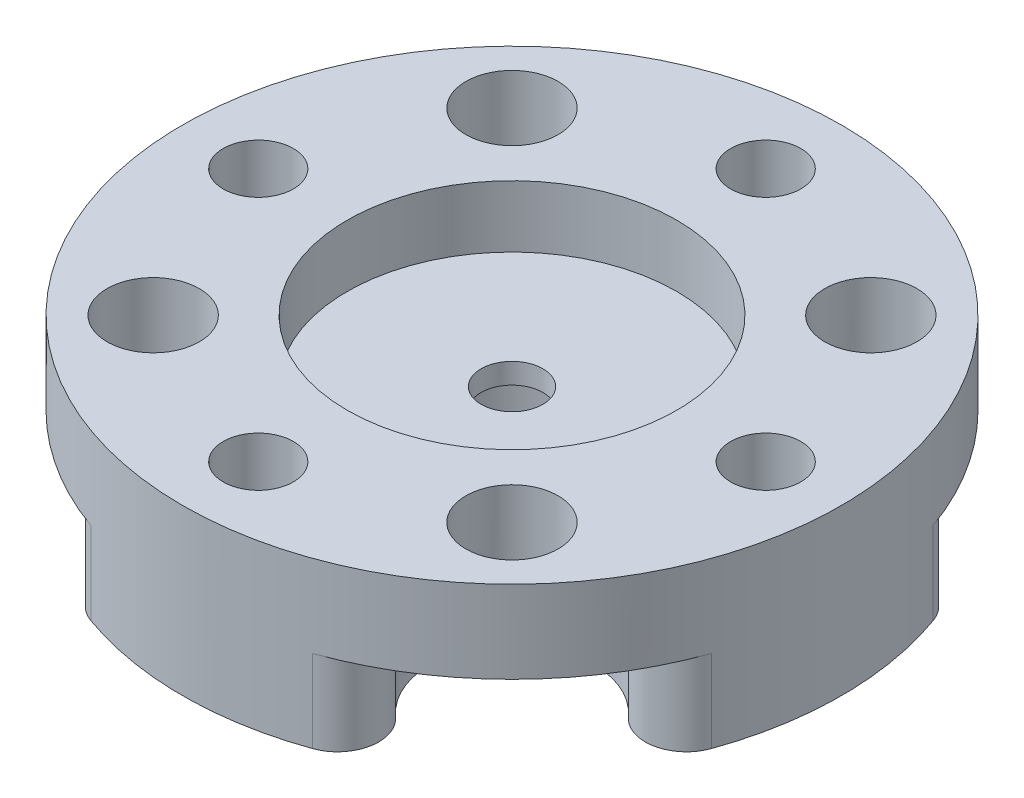
ISO-10303-21;
HEADER;
FILE_DESCRIPTION(('STEP AP214'),'2;1');
FILE_NAME('part.step','',(''),(''),'','','');
FILE_SCHEMA(('AUTOMOTIVE_DESIGN { 1 0 10303 214 1 1 1 1 }'));
ENDSEC;
DATA;
#1=APPLICATION_CONTEXT('core data for automotive mechanical design processes');
#2=APPLICATION_PROTOCOL_DEFINITION('international standard','automotive_design',2000,#1);
#3=PRODUCT_CONTEXT('',#1,'mechanical');
#4=PRODUCT('Part','Part','',(#3));
#5=PRODUCT_RELATED_PRODUCT_CATEGORY('part','',(#4));
#6=PRODUCT_DEFINITION_FORMATION('','',#4);
#7=PRODUCT_DEFINITION_CONTEXT('part definition',#1,'design');
#8=PRODUCT_DEFINITION('design','',#6,#7);
#9=PRODUCT_DEFINITION_SHAPE('','',#8);
#10=(LENGTH_UNIT() NAMED_UNIT(*) SI_UNIT(.MILLI.,.METRE.));
#11=(NAMED_UNIT(*) PLANE_ANGLE_UNIT() SI_UNIT($,.RADIAN.));
#12=(NAMED_UNIT(*) SI_UNIT($,.STERADIAN.) SOLID_ANGLE_UNIT());
#13=UNCERTAINTY_MEASURE_WITH_UNIT(LENGTH_MEASURE(1.E-05),#10,'distance_accuracy_value','');
#14=(GEOMETRIC_REPRESENTATION_CONTEXT(3) GLOBAL_UNCERTAINTY_ASSIGNED_CONTEXT((#13)) GLOBAL_UNIT_ASSIGNED_CONTEXT((#10,
#11,#12)) REPRESENTATION_CONTEXT('',''));
#15=CARTESIAN_POINT('',(0.,0.,0.));
#16=DIRECTION('',(0.,0.,1.));
#17=DIRECTION('',(1.,0.,0.));
#18=AXIS2_PLACEMENT_3D('',#15,#16,#17);
#19=CARTESIAN_POINT('',(-6.91479721322316,0.,6.91479721322334));
#20=DIRECTION('',(0.,1.,0.));
#21=DIRECTION('',(0.,0.,1.));
#22=AXIS2_PLACEMENT_3D('',#19,#20,#21);
#23=CYLINDRICAL_SURFACE('',#22,1.778);
#24=CARTESIAN_POINT('',(-6.91479721322316,6.35,6.91479721322334));
#25=DIRECTION('',(0.,1.,0.));
#26=DIRECTION('',(-1.,0.,0.));
#27=AXIS2_PLACEMENT_3D('',#24,#25,#26);
#28=CIRCLE('',#27,1.778);
#29=CARTESIAN_POINT('',(-8.69279721322316,6.35,6.91479721322335));
#30=VERTEX_POINT('',#29);
#31=EDGE_CURVE('E358',#30,#30,#28,.T.);
#32=ORIENTED_EDGE('',*,*,#31,.T.);
#33=EDGE_LOOP('',(#32));
#34=FACE_BOUND('',#33,.T.);
#35=CARTESIAN_POINT('',(-6.91479721322316,3.175,6.91479721322334));
#36=DIRECTION('',(0.,-1.,0.));
#37=DIRECTION('',(0.,0.,-1.));
#38=AXIS2_PLACEMENT_3D('',#35,#36,#37);
#39=CIRCLE('',#38,1.778);
#40=CARTESIAN_POINT('',(-6.91479721322316,3.175,5.13679721322334));
#41=VERTEX_POINT('',#40);
#42=EDGE_CURVE('E209',#41,#41,#39,.F.);
#43=ORIENTED_EDGE('',*,*,#42,.F.);
#44=EDGE_LOOP('',(#43));
#45=FACE_BOUND('',#44,.T.);
#46=ADVANCED_FACE('F36',(#34,#45),#23,.F.);
#47=CARTESIAN_POINT('',(-6.91479721322326,0.,-6.91479721322323));
#48=DIRECTION('',(0.,1.,0.));
#49=DIRECTION('',(0.,0.,1.));
#50=AXIS2_PLACEMENT_3D('',#47,#48,#49);
#51=CYLINDRICAL_SURFACE('',#50,1.778);
#52=CARTESIAN_POINT('',(-6.91479721322326,6.35,-6.91479721322323));
#53=DIRECTION('',(0.,1.,0.));
#54=DIRECTION('',(0.,0.,-1.));
#55=AXIS2_PLACEMENT_3D('',#52,#53,#54);
#56=CIRCLE('',#55,1.778);
#57=CARTESIAN_POINT('',(-6.91479721322326,6.35,-8.69279721322324));
#58=VERTEX_POINT('',#57);
#59=EDGE_CURVE('E361',#58,#58,#56,.T.);
#60=ORIENTED_EDGE('',*,*,#59,.T.);
#61=EDGE_LOOP('',(#60));
#62=FACE_BOUND('',#61,.T.);
#63=CARTESIAN_POINT('',(-6.91479721322326,3.175,-6.91479721322323));
#64=DIRECTION('',(0.,-1.,0.));
#65=DIRECTION('',(0.,0.,-1.));
#66=AXIS2_PLACEMENT_3D('',#63,#64,#65);
#67=CIRCLE('',#66,1.778);
#68=CARTESIAN_POINT('',(-6.91479721322326,3.175,-8.69279721322324));
#69=VERTEX_POINT('',#68);
#70=EDGE_CURVE('E205',#69,#69,#67,.F.);
#71=ORIENTED_EDGE('',*,*,#70,.F.);
#72=EDGE_LOOP('',(#71));
#73=FACE_BOUND('',#72,.T.);
#74=ADVANCED_FACE('F405',(#62,#73),#51,.F.);
#75=CARTESIAN_POINT('',(6.91479721322321,0.,-6.91479721322329));
#76=DIRECTION('',(0.,1.,0.));
#77=DIRECTION('',(0.,0.,1.));
#78=AXIS2_PLACEMENT_3D('',#75,#76,#77);
#79=CYLINDRICAL_SURFACE('',#78,1.778);
#80=CARTESIAN_POINT('',(6.91479721322321,6.35,-6.91479721322329));
#81=DIRECTION('',(0.,1.,0.));
#82=DIRECTION('',(1.,0.,0.));
#83=AXIS2_PLACEMENT_3D('',#80,#81,#82);
#84=CIRCLE('',#83,1.778);
#85=CARTESIAN_POINT('',(8.69279721322321,6.35,-6.91479721322329));
#86=VERTEX_POINT('',#85);
#87=EDGE_CURVE('E364',#86,#86,#84,.T.);
#88=ORIENTED_EDGE('',*,*,#87,.T.);
#89=EDGE_LOOP('',(#88));
#90=FACE_BOUND('',#89,.T.);
#91=CARTESIAN_POINT('',(6.91479721322321,3.175,-6.91479721322329));
#92=DIRECTION('',(0.,-1.,0.));
#93=DIRECTION('',(0.,0.,-1.));
#94=AXIS2_PLACEMENT_3D('',#91,#92,#93);
#95=CIRCLE('',#94,1.778);
#96=CARTESIAN_POINT('',(6.91479721322321,3.175,-8.69279721322329));
#97=VERTEX_POINT('',#96);
#98=EDGE_CURVE('E200',#97,#97,#95,.F.);
#99=ORIENTED_EDGE('',*,*,#98,.F.);
#100=EDGE_LOOP('',(#99));
#101=FACE_BOUND('',#100,.T.);
#102=ADVANCED_FACE('F411',(#90,#101),#79,.F.);
#103=CARTESIAN_POINT('',(6.91479721322326,0.,6.91479721322323));
#104=DIRECTION('',(0.,1.,0.));
#105=DIRECTION('',(0.,0.,1.));
#106=AXIS2_PLACEMENT_3D('',#103,#104,#105);
#107=CYLINDRICAL_SURFACE('',#106,1.778);
#108=CARTESIAN_POINT('',(6.91479721322326,6.35,6.91479721322323));
#109=DIRECTION('',(0.,1.,0.));
#110=DIRECTION('',(0.,0.,1.));
#111=AXIS2_PLACEMENT_3D('',#108,#109,#110);
#112=CIRCLE('',#111,1.778);
#113=CARTESIAN_POINT('',(6.91479721322326,6.35,8.69279721322324));
#114=VERTEX_POINT('',#113);
#115=EDGE_CURVE('E288',#114,#114,#112,.T.);
#116=ORIENTED_EDGE('',*,*,#115,.T.);
#117=EDGE_LOOP('',(#116));
#118=FACE_BOUND('',#117,.T.);
#119=CARTESIAN_POINT('',(6.91479721322326,3.175,6.91479721322323));
#120=DIRECTION('',(0.,-1.,0.));
#121=DIRECTION('',(0.,0.,-1.));
#122=AXIS2_PLACEMENT_3D('',#119,#120,#121);
#123=CIRCLE('',#122,1.778);
#124=CARTESIAN_POINT('',(6.91479721322326,3.175,5.13679721322323));
#125=VERTEX_POINT('',#124);
#126=EDGE_CURVE('E195',#125,#125,#123,.F.);
#127=ORIENTED_EDGE('',*,*,#126,.F.);
#128=EDGE_LOOP('',(#127));
#129=FACE_BOUND('',#128,.T.);
#130=ADVANCED_FACE('F420',(#118,#129),#107,.F.);
#131=CARTESIAN_POINT('',(0.,6.35,0.));
#132=DIRECTION('',(0.,-1.,0.));
#133=DIRECTION('',(0.,0.,-1.));
#134=AXIS2_PLACEMENT_3D('',#131,#132,#133);
#135=CYLINDRICAL_SURFACE('',#134,12.7);
#136=CARTESIAN_POINT('',(0.,3.175,0.));
#137=DIRECTION('',(0.,-1.,0.));
#138=DIRECTION('',(0.,0.,-1.));
#139=AXIS2_PLACEMENT_3D('',#136,#137,#138);
#140=CIRCLE('',#139,12.7);
#141=CARTESIAN_POINT('',(11.9592831816571,3.175,4.27382098138569));
#142=VERTEX_POINT('',#141);
#143=CARTESIAN_POINT('',(4.27382098138574,3.175,11.9592831816571));
#144=VERTEX_POINT('',#143);
#145=EDGE_CURVE('E198',#142,#144,#140,.T.);
#146=ORIENTED_EDGE('',*,*,#145,.F.);
#147=DIRECTION('',(0.,-1.,0.));
#148=VECTOR('',#147,1.);
#149=CARTESIAN_POINT('',(11.9592831816571,6.35,4.27382098138569));
#150=LINE('',#149,#148);
#151=CARTESIAN_POINT('',(11.9592831816571,0.,4.27382098138569));
#152=VERTEX_POINT('',#151);
#153=EDGE_CURVE('E228',#142,#152,#150,.T.);
#154=ORIENTED_EDGE('',*,*,#153,.T.);
#155=CARTESIAN_POINT('',(0.,0.,0.));
#156=DIRECTION('',(0.,1.,0.));
#157=DIRECTION('',(0.,0.,1.));
#158=AXIS2_PLACEMENT_3D('',#155,#156,#157);
#159=CIRCLE('',#158,12.7);
#160=CARTESIAN_POINT('',(11.9592831816571,0.,-4.27382098138578));
#161=VERTEX_POINT('',#160);
#162=EDGE_CURVE('E183',#152,#161,#159,.T.);
#163=ORIENTED_EDGE('',*,*,#162,.T.);
#164=DIRECTION('',(0.,-1.,0.));
#165=VECTOR('',#164,1.);
#166=CARTESIAN_POINT('',(11.9592831816571,6.35,-4.27382098138578));
#167=LINE('',#166,#165);
#168=CARTESIAN_POINT('',(11.9592831816571,3.175,-4.27382098138578));
#169=VERTEX_POINT('',#168);
#170=EDGE_CURVE('E222',#161,#169,#167,.F.);
#171=ORIENTED_EDGE('',*,*,#170,.T.);
#172=CARTESIAN_POINT('',(0.,3.175,0.));
#173=DIRECTION('',(0.,-1.,0.));
#174=DIRECTION('',(0.,0.,-1.));
#175=AXIS2_PLACEMENT_3D('',#172,#173,#174);
#176=CIRCLE('',#175,12.7);
#177=CARTESIAN_POINT('',(4.27382098138565,3.175,-11.9592831816572));
#178=VERTEX_POINT('',#177);
#179=EDGE_CURVE('E203',#178,#169,#176,.T.);
#180=ORIENTED_EDGE('',*,*,#179,.F.);
#181=DIRECTION('',(0.,-1.,0.));
#182=VECTOR('',#181,1.);
#183=CARTESIAN_POINT('',(4.27382098138565,6.35,-11.9592831816572));
#184=LINE('',#183,#182);
#185=CARTESIAN_POINT('',(4.27382098138565,0.,-11.9592831816572));
#186=VERTEX_POINT('',#185);
#187=EDGE_CURVE('E171',#178,#186,#184,.T.);
#188=ORIENTED_EDGE('',*,*,#187,.T.);
#189=CARTESIAN_POINT('',(-4.27382098138574,0.,-11.9592831816571));
#190=VERTEX_POINT('',#189);
#191=EDGE_CURVE('E179',#186,#190,#159,.T.);
#192=ORIENTED_EDGE('',*,*,#191,.T.);
#193=DIRECTION('',(0.,-1.,0.));
#194=VECTOR('',#193,1.);
#195=CARTESIAN_POINT('',(-4.27382098138574,6.35,-11.9592831816571));
#196=LINE('',#195,#194);
#197=CARTESIAN_POINT('',(-4.27382098138574,3.175,-11.9592831816571));
#198=VERTEX_POINT('',#197);
#199=EDGE_CURVE('E172',#190,#198,#196,.F.);
#200=ORIENTED_EDGE('',*,*,#199,.T.);
#201=CARTESIAN_POINT('',(0.,3.175,0.));
#202=DIRECTION('',(0.,-1.,0.));
#203=DIRECTION('',(0.,0.,-1.));
#204=AXIS2_PLACEMENT_3D('',#201,#202,#203);
#205=CIRCLE('',#204,12.7);
#206=CARTESIAN_POINT('',(-11.9592831816571,3.175,-4.27382098138569));
#207=VERTEX_POINT('',#206);
#208=EDGE_CURVE('E169',#207,#198,#205,.T.);
#209=ORIENTED_EDGE('',*,*,#208,.F.);
#210=DIRECTION('',(0.,-1.,0.));
#211=VECTOR('',#210,1.);
#212=CARTESIAN_POINT('',(-11.9592831816571,6.35,-4.27382098138569));
#213=LINE('',#212,#211);
#214=CARTESIAN_POINT('',(-11.9592831816571,0.,-4.27382098138569));
#215=VERTEX_POINT('',#214);
#216=EDGE_CURVE('E152',#207,#215,#213,.T.);
#217=ORIENTED_EDGE('',*,*,#216,.T.);
#218=CARTESIAN_POINT('',(-11.9592831816571,0.,4.27382098138586));
#219=VERTEX_POINT('',#218);
#220=EDGE_CURVE('E166',#215,#219,#159,.T.);
#221=ORIENTED_EDGE('',*,*,#220,.T.);
#222=DIRECTION('',(0.,-1.,0.));
#223=VECTOR('',#222,1.);
#224=CARTESIAN_POINT('',(-11.9592831816571,6.35,4.27382098138586));
#225=LINE('',#224,#223);
#226=CARTESIAN_POINT('',(-11.9592831816571,3.175,4.27382098138586));
#227=VERTEX_POINT('',#226);
#228=EDGE_CURVE('E214',#219,#227,#225,.F.);
#229=ORIENTED_EDGE('',*,*,#228,.T.);
#230=CARTESIAN_POINT('',(0.,3.175,0.));
#231=DIRECTION('',(0.,-1.,0.));
#232=DIRECTION('',(0.,0.,-1.));
#233=AXIS2_PLACEMENT_3D('',#230,#231,#232);
#234=CIRCLE('',#233,12.7);
#235=CARTESIAN_POINT('',(-4.27382098138556,3.175,11.9592831816572));
#236=VERTEX_POINT('',#235);
#237=EDGE_CURVE('E212',#236,#227,#234,.T.);
#238=ORIENTED_EDGE('',*,*,#237,.F.);
#239=DIRECTION('',(0.,-1.,0.));
#240=VECTOR('',#239,1.);
#241=CARTESIAN_POINT('',(-4.27382098138556,6.35,11.9592831816572));
#242=LINE('',#241,#240);
#243=CARTESIAN_POINT('',(-4.27382098138556,0.,11.9592831816572));
#244=VERTEX_POINT('',#243);
#245=EDGE_CURVE('E216',#236,#244,#242,.T.);
#246=ORIENTED_EDGE('',*,*,#245,.T.);
#247=CARTESIAN_POINT('',(4.27382098138574,0.,11.9592831816571));
#248=VERTEX_POINT('',#247);
#249=EDGE_CURVE('E180',#244,#248,#159,.T.);
#250=ORIENTED_EDGE('',*,*,#249,.T.);
#251=DIRECTION('',(0.,-1.,0.));
#252=VECTOR('',#251,1.);
#253=CARTESIAN_POINT('',(4.27382098138574,6.35,11.9592831816571));
#254=LINE('',#253,#252);
#255=EDGE_CURVE('E225',#248,#144,#254,.F.);
#256=ORIENTED_EDGE('',*,*,#255,.T.);
#257=EDGE_LOOP('',(#146,#154,#163,#171,#180,#188,#192,#200,#209,#217,#221,#229,#238,#246,#250,#256));
#258=FACE_BOUND('',#257,.T.);
#259=CARTESIAN_POINT('',(0.,6.35,0.));
#260=DIRECTION('',(0.,1.,0.));
#261=DIRECTION('',(0.,0.,1.));
#262=AXIS2_PLACEMENT_3D('',#259,#260,#261);
#263=CIRCLE('',#262,12.7);
#264=CARTESIAN_POINT('',(0.,6.35,12.7));
#265=VERTEX_POINT('',#264);
#266=EDGE_CURVE('E188',#265,#265,#263,.T.);
#267=ORIENTED_EDGE('',*,*,#266,.F.);
#268=EDGE_LOOP('',(#267));
#269=FACE_BOUND('',#268,.T.);
#270=ADVANCED_FACE('F163',(#258,#269),#135,.T.);
#271=CARTESIAN_POINT('',(0.,6.35,0.));
#272=DIRECTION('',(0.,1.,0.));
#273=DIRECTION('',(0.,0.,1.));
#274=AXIS2_PLACEMENT_3D('',#271,#272,#273);
#275=PLANE('',#274);
#276=ORIENTED_EDGE('',*,*,#31,.F.);
#277=EDGE_LOOP('',(#276));
#278=FACE_BOUND('',#277,.T.);
#279=ORIENTED_EDGE('',*,*,#59,.F.);
#280=EDGE_LOOP('',(#279));
#281=FACE_BOUND('',#280,.T.);
#282=ORIENTED_EDGE('',*,*,#87,.F.);
#283=EDGE_LOOP('',(#282));
#284=FACE_BOUND('',#283,.T.);
#285=CARTESIAN_POINT('',(-1.03627170142527E-13,6.35,-9.779));
#286=DIRECTION('',(0.,1.,0.));
#287=DIRECTION('',(0.,0.,1.));
#288=AXIS2_PLACEMENT_3D('',#285,#286,#287);
#289=CIRCLE('',#288,1.35254999999999);
#290=CARTESIAN_POINT('',(-1.03627170142527E-13,6.35,-8.42645000000001));
#291=VERTEX_POINT('',#290);
#292=EDGE_CURVE('E367',#291,#291,#289,.T.);
#293=ORIENTED_EDGE('',*,*,#292,.F.);
#294=EDGE_LOOP('',(#293));
#295=FACE_BOUND('',#294,.T.);
#296=CARTESIAN_POINT('',(9.779,6.35,0.));
#297=DIRECTION('',(0.,1.,0.));
#298=DIRECTION('',(0.,0.,1.));
#299=AXIS2_PLACEMENT_3D('',#296,#297,#298);
#300=CIRCLE('',#299,1.35254999999999);
#301=CARTESIAN_POINT('',(9.779,6.35,1.35254999999999));
#302=VERTEX_POINT('',#301);
#303=EDGE_CURVE('E373',#302,#302,#300,.T.);
#304=ORIENTED_EDGE('',*,*,#303,.F.);
#305=EDGE_LOOP('',(#304));
#306=FACE_BOUND('',#305,.T.);
#307=CARTESIAN_POINT('',(0.,6.35,9.779));
#308=DIRECTION('',(0.,1.,0.));
#309=DIRECTION('',(0.,0.,1.));
#310=AXIS2_PLACEMENT_3D('',#307,#308,#309);
#311=CIRCLE('',#310,1.35254999999999);
#312=CARTESIAN_POINT('',(0.,6.35,11.13155));
#313=VERTEX_POINT('',#312);
#314=EDGE_CURVE('E303',#313,#313,#311,.T.);
#315=ORIENTED_EDGE('',*,*,#314,.F.);
#316=EDGE_LOOP('',(#315));
#317=FACE_BOUND('',#316,.T.);
#318=ORIENTED_EDGE('',*,*,#115,.F.);
#319=EDGE_LOOP('',(#318));
#320=FACE_BOUND('',#319,.T.);
#321=CARTESIAN_POINT('',(-9.779,6.35,0.));
#322=DIRECTION('',(0.,1.,0.));
#323=DIRECTION('',(0.,0.,1.));
#324=AXIS2_PLACEMENT_3D('',#321,#322,#323);
#325=CIRCLE('',#324,1.35254999999999);
#326=CARTESIAN_POINT('',(-9.779,6.35,1.35254999999999));
#327=VERTEX_POINT('',#326);
#328=EDGE_CURVE('E308',#327,#327,#325,.T.);
#329=ORIENTED_EDGE('',*,*,#328,.F.);
#330=EDGE_LOOP('',(#329));
#331=FACE_BOUND('',#330,.T.);
#332=CARTESIAN_POINT('',(0.,6.35,0.));
#333=DIRECTION('',(0.,1.,0.));
#334=DIRECTION('',(0.,0.,1.));
#335=AXIS2_PLACEMENT_3D('',#332,#333,#334);
#336=CIRCLE('',#335,6.35);
#337=CARTESIAN_POINT('',(0.,6.35,6.35));
#338=VERTEX_POINT('',#337);
#339=EDGE_CURVE('E319',#338,#338,#336,.T.);
#340=ORIENTED_EDGE('',*,*,#339,.F.);
#341=EDGE_LOOP('',(#340));
#342=FACE_BOUND('',#341,.T.);
#343=ORIENTED_EDGE('',*,*,#266,.T.);
#344=EDGE_LOOP('',(#343));
#345=FACE_BOUND('',#344,.T.);
#346=ADVANCED_FACE('F328',(#278,#281,#284,#295,#306,#317,#320,#331,#342,#345),#275,.T.);
#347=CARTESIAN_POINT('',(0.,0.,0.));
#348=DIRECTION('',(0.,1.,0.));
#349=DIRECTION('',(0.,0.,1.));
#350=AXIS2_PLACEMENT_3D('',#347,#348,#349);
#351=PLANE('',#350);
#352=CARTESIAN_POINT('',(-1.03627170142527E-13,0.,-9.779));
#353=DIRECTION('',(0.,1.,0.));
#354=DIRECTION('',(0.,0.,1.));
#355=AXIS2_PLACEMENT_3D('',#352,#353,#354);
#356=CIRCLE('',#355,1.35255);
#357=CARTESIAN_POINT('',(-1.03627170142527E-13,0.,-8.42645));
#358=VERTEX_POINT('',#357);
#359=EDGE_CURVE('E370',#358,#358,#356,.T.);
#360=ORIENTED_EDGE('',*,*,#359,.T.);
#361=EDGE_LOOP('',(#360));
#362=FACE_BOUND('',#361,.T.);
#363=CARTESIAN_POINT('',(9.779,0.,0.));
#364=DIRECTION('',(0.,1.,0.));
#365=DIRECTION('',(0.,0.,1.));
#366=AXIS2_PLACEMENT_3D('',#363,#364,#365);
#367=CIRCLE('',#366,1.35255);
#368=CARTESIAN_POINT('',(9.779,0.,1.35255));
#369=VERTEX_POINT('',#368);
#370=EDGE_CURVE('E376',#369,#369,#367,.T.);
#371=ORIENTED_EDGE('',*,*,#370,.T.);
#372=EDGE_LOOP('',(#371));
#373=FACE_BOUND('',#372,.T.);
#374=CARTESIAN_POINT('',(0.,0.,9.779));
#375=DIRECTION('',(0.,1.,0.));
#376=DIRECTION('',(0.,0.,1.));
#377=AXIS2_PLACEMENT_3D('',#374,#375,#376);
#378=CIRCLE('',#377,1.35255);
#379=CARTESIAN_POINT('',(0.,0.,11.13155));
#380=VERTEX_POINT('',#379);
#381=EDGE_CURVE('E299',#380,#380,#378,.T.);
#382=ORIENTED_EDGE('',*,*,#381,.T.);
#383=EDGE_LOOP('',(#382));
#384=FACE_BOUND('',#383,.T.);
#385=CARTESIAN_POINT('',(-9.779,0.,0.));
#386=DIRECTION('',(0.,1.,0.));
#387=DIRECTION('',(0.,0.,1.));
#388=AXIS2_PLACEMENT_3D('',#385,#386,#387);
#389=CIRCLE('',#388,1.35255);
#390=CARTESIAN_POINT('',(-9.779,0.,1.35255));
#391=VERTEX_POINT('',#390);
#392=EDGE_CURVE('E311',#391,#391,#389,.T.);
#393=ORIENTED_EDGE('',*,*,#392,.T.);
#394=EDGE_LOOP('',(#393));
#395=FACE_BOUND('',#394,.T.);
#396=CARTESIAN_POINT('',(0.,0.,0.));
#397=DIRECTION('',(0.,-1.,0.));
#398=DIRECTION('',(0.,0.,-1.));
#399=AXIS2_PLACEMENT_3D('',#396,#397,#398);
#400=CIRCLE('',#399,3.1115);
#401=CARTESIAN_POINT('',(0.,0.,-3.1115));
#402=VERTEX_POINT('',#401);
#403=EDGE_CURVE('E193',#402,#402,#400,.T.);
#404=ORIENTED_EDGE('',*,*,#403,.F.);
#405=EDGE_LOOP('',(#404));
#406=FACE_BOUND('',#405,.T.);
#407=ORIENTED_EDGE('',*,*,#162,.F.);
#408=CARTESIAN_POINT('',(10.46437278395,0.,3.73959335871248));
#409=DIRECTION('',(0.,1.,0.));
#410=DIRECTION('',(0.,0.,1.));
#411=AXIS2_PLACEMENT_3D('',#408,#409,#410);
#412=CIRCLE('',#411,1.5875);
#413=CARTESIAN_POINT('',(9.28118092704109,0.,4.7979946435494));
#414=VERTEX_POINT('',#413);
#415=EDGE_CURVE('E240',#152,#414,#412,.F.);
#416=ORIENTED_EDGE('',*,*,#415,.T.);
#417=CARTESIAN_POINT('',(6.91479721322326,0.,6.91479721322323));
#418=DIRECTION('',(0.,-1.,0.));
#419=DIRECTION('',(0.,0.,-1.));
#420=AXIS2_PLACEMENT_3D('',#417,#418,#419);
#421=CIRCLE('',#420,3.175);
#422=CARTESIAN_POINT('',(4.79799464354943,0.,9.28118092704107));
#423=VERTEX_POINT('',#422);
#424=EDGE_CURVE('E280',#423,#414,#421,.T.);
#425=ORIENTED_EDGE('',*,*,#424,.F.);
#426=CARTESIAN_POINT('',(3.73959335871252,0.,10.46437278395));
#427=DIRECTION('',(0.,1.,0.));
#428=DIRECTION('',(0.,0.,1.));
#429=AXIS2_PLACEMENT_3D('',#426,#427,#428);
#430=CIRCLE('',#429,1.5875);
#431=EDGE_CURVE('E238',#423,#248,#430,.F.);
#432=ORIENTED_EDGE('',*,*,#431,.T.);
#433=ORIENTED_EDGE('',*,*,#249,.F.);
#434=CARTESIAN_POINT('',(-3.73959335871237,0.,10.46437278395));
#435=DIRECTION('',(0.,1.,0.));
#436=DIRECTION('',(0.,0.,1.));
#437=AXIS2_PLACEMENT_3D('',#434,#435,#436);
#438=CIRCLE('',#437,1.5875);
#439=CARTESIAN_POINT('',(-4.7979946435493,0.,9.28118092704114));
#440=VERTEX_POINT('',#439);
#441=EDGE_CURVE('E232',#244,#440,#438,.F.);
#442=ORIENTED_EDGE('',*,*,#441,.T.);
#443=CARTESIAN_POINT('',(-6.91479721322316,0.,6.91479721322334));
#444=DIRECTION('',(0.,-1.,0.));
#445=DIRECTION('',(1.,0.,0.));
#446=AXIS2_PLACEMENT_3D('',#443,#444,#445);
#447=CIRCLE('',#446,3.175);
#448=CARTESIAN_POINT('',(-9.28118092704102,0.,4.79799464354953));
#449=VERTEX_POINT('',#448);
#450=EDGE_CURVE('E471',#449,#440,#447,.T.);
#451=ORIENTED_EDGE('',*,*,#450,.F.);
#452=CARTESIAN_POINT('',(-10.4643727839499,0.,3.73959335871263));
#453=DIRECTION('',(0.,1.,0.));
#454=DIRECTION('',(0.,0.,1.));
#455=AXIS2_PLACEMENT_3D('',#452,#453,#454);
#456=CIRCLE('',#455,1.5875);
#457=EDGE_CURVE('E178',#449,#219,#456,.F.);
#458=ORIENTED_EDGE('',*,*,#457,.T.);
#459=ORIENTED_EDGE('',*,*,#220,.F.);
#460=CARTESIAN_POINT('',(-10.46437278395,0.,-3.73959335871248));
#461=DIRECTION('',(0.,1.,0.));
#462=DIRECTION('',(0.,0.,1.));
#463=AXIS2_PLACEMENT_3D('',#460,#461,#462);
#464=CIRCLE('',#463,1.5875);
#465=CARTESIAN_POINT('',(-9.28118092704109,0.,-4.7979946435494));
#466=VERTEX_POINT('',#465);
#467=EDGE_CURVE('E148',#215,#466,#464,.F.);
#468=ORIENTED_EDGE('',*,*,#467,.T.);
#469=CARTESIAN_POINT('',(-6.91479721322326,0.,-6.91479721322323));
#470=DIRECTION('',(0.,-1.,0.));
#471=DIRECTION('',(0.,0.,1.));
#472=AXIS2_PLACEMENT_3D('',#469,#470,#471);
#473=CIRCLE('',#472,3.175);
#474=CARTESIAN_POINT('',(-4.79799464354943,0.,-9.28118092704107));
#475=VERTEX_POINT('',#474);
#476=EDGE_CURVE('E476',#475,#466,#473,.T.);
#477=ORIENTED_EDGE('',*,*,#476,.F.);
#478=CARTESIAN_POINT('',(-3.73959335871252,0.,-10.46437278395));
#479=DIRECTION('',(0.,1.,0.));
#480=DIRECTION('',(0.,0.,1.));
#481=AXIS2_PLACEMENT_3D('',#478,#479,#480);
#482=CIRCLE('',#481,1.5875);
#483=EDGE_CURVE('E159',#475,#190,#482,.F.);
#484=ORIENTED_EDGE('',*,*,#483,.T.);
#485=ORIENTED_EDGE('',*,*,#191,.F.);
#486=CARTESIAN_POINT('',(3.73959335871244,0.,-10.46437278395));
#487=DIRECTION('',(0.,1.,0.));
#488=DIRECTION('',(0.,0.,1.));
#489=AXIS2_PLACEMENT_3D('',#486,#487,#488);
#490=CIRCLE('',#489,1.5875);
#491=CARTESIAN_POINT('',(4.79799464354937,0.,-9.28118092704111));
#492=VERTEX_POINT('',#491);
#493=EDGE_CURVE('E158',#186,#492,#490,.F.);
#494=ORIENTED_EDGE('',*,*,#493,.T.);
#495=CARTESIAN_POINT('',(6.91479721322321,0.,-6.91479721322329));
#496=DIRECTION('',(0.,-1.,0.));
#497=DIRECTION('',(-1.,0.,0.));
#498=AXIS2_PLACEMENT_3D('',#495,#496,#497);
#499=CIRCLE('',#498,3.175);
#500=CARTESIAN_POINT('',(9.28118092704105,0.,-4.79799464354947));
#501=VERTEX_POINT('',#500);
#502=EDGE_CURVE('E351',#501,#492,#499,.T.);
#503=ORIENTED_EDGE('',*,*,#502,.F.);
#504=CARTESIAN_POINT('',(10.46437278395,0.,-3.73959335871256));
#505=DIRECTION('',(0.,1.,0.));
#506=DIRECTION('',(0.,0.,1.));
#507=AXIS2_PLACEMENT_3D('',#504,#505,#506);
#508=CIRCLE('',#507,1.5875);
#509=EDGE_CURVE('E236',#501,#161,#508,.F.);
#510=ORIENTED_EDGE('',*,*,#509,.T.);
#511=EDGE_LOOP('',(#407,#416,#425,#432,#433,#442,#451,#458,#459,#468,#477,#484,#485,#494,#503,#510));
#512=FACE_BOUND('',#511,.T.);
#513=ADVANCED_FACE('F175',(#362,#373,#384,#395,#406,#512),#351,.F.);
#514=CARTESIAN_POINT('',(0.,3.96875,0.));
#515=DIRECTION('',(0.,1.,0.));
#516=DIRECTION('',(0.,0.,1.));
#517=AXIS2_PLACEMENT_3D('',#514,#515,#516);
#518=CYLINDRICAL_SURFACE('',#517,6.35);
#519=CARTESIAN_POINT('',(0.,3.96875,0.));
#520=DIRECTION('',(0.,1.,0.));
#521=DIRECTION('',(0.,0.,1.));
#522=AXIS2_PLACEMENT_3D('',#519,#520,#521);
#523=CIRCLE('',#522,6.35);
#524=CARTESIAN_POINT('',(0.,3.96875,6.35));
#525=VERTEX_POINT('',#524);
#526=EDGE_CURVE('E185',#525,#525,#523,.T.);
#527=ORIENTED_EDGE('',*,*,#526,.F.);
#528=EDGE_LOOP('',(#527));
#529=FACE_BOUND('',#528,.T.);
#530=ORIENTED_EDGE('',*,*,#339,.T.);
#531=EDGE_LOOP('',(#530));
#532=FACE_BOUND('',#531,.T.);
#533=ADVANCED_FACE('F326',(#529,#532),#518,.F.);
#534=CARTESIAN_POINT('',(0.,3.96875,0.));
#535=DIRECTION('',(0.,1.,0.));
#536=DIRECTION('',(0.,0.,1.));
#537=AXIS2_PLACEMENT_3D('',#534,#535,#536);
#538=PLANE('',#537);
#539=CARTESIAN_POINT('',(0.,3.96875,0.));
#540=DIRECTION('',(0.,1.,0.));
#541=DIRECTION('',(0.,0.,1.));
#542=AXIS2_PLACEMENT_3D('',#539,#540,#541);
#543=CIRCLE('',#542,1.190625);
#544=CARTESIAN_POINT('',(0.,3.96875,1.190625));
#545=VERTEX_POINT('',#544);
#546=EDGE_CURVE('E194',#545,#545,#543,.T.);
#547=ORIENTED_EDGE('',*,*,#546,.F.);
#548=EDGE_LOOP('',(#547));
#549=FACE_BOUND('',#548,.T.);
#550=ORIENTED_EDGE('',*,*,#526,.T.);
#551=EDGE_LOOP('',(#550));
#552=FACE_BOUND('',#551,.T.);
#553=ADVANCED_FACE('F609',(#549,#552),#538,.T.);
#554=CARTESIAN_POINT('',(0.,3.175,0.));
#555=DIRECTION('',(0.,-1.,0.));
#556=DIRECTION('',(0.,0.,-1.));
#557=AXIS2_PLACEMENT_3D('',#554,#555,#556);
#558=CYLINDRICAL_SURFACE('',#557,3.1115);
#559=CARTESIAN_POINT('',(0.,3.175,0.));
#560=DIRECTION('',(0.,-1.,0.));
#561=DIRECTION('',(0.,0.,-1.));
#562=AXIS2_PLACEMENT_3D('',#559,#560,#561);
#563=CIRCLE('',#562,3.1115);
#564=CARTESIAN_POINT('',(0.,3.175,-3.1115));
#565=VERTEX_POINT('',#564);
#566=EDGE_CURVE('E316',#565,#565,#563,.T.);
#567=ORIENTED_EDGE('',*,*,#566,.F.);
#568=EDGE_LOOP('',(#567));
#569=FACE_BOUND('',#568,.T.);
#570=ORIENTED_EDGE('',*,*,#403,.T.);
#571=EDGE_LOOP('',(#570));
#572=FACE_BOUND('',#571,.T.);
#573=ADVANCED_FACE('F601',(#569,#572),#558,.F.);
#574=CARTESIAN_POINT('',(0.,3.175,0.));
#575=DIRECTION('',(0.,-1.,0.));
#576=DIRECTION('',(0.,0.,-1.));
#577=AXIS2_PLACEMENT_3D('',#574,#575,#576);
#578=PLANE('',#577);
#579=CARTESIAN_POINT('',(0.,3.175,0.));
#580=DIRECTION('',(0.,-1.,0.));
#581=DIRECTION('',(0.,0.,-1.));
#582=AXIS2_PLACEMENT_3D('',#579,#580,#581);
#583=CIRCLE('',#582,1.190625);
#584=CARTESIAN_POINT('',(0.,3.175,-1.190625));
#585=VERTEX_POINT('',#584);
#586=EDGE_CURVE('E190',#585,#585,#583,.T.);
#587=ORIENTED_EDGE('',*,*,#586,.F.);
#588=EDGE_LOOP('',(#587));
#589=FACE_BOUND('',#588,.T.);
#590=ORIENTED_EDGE('',*,*,#566,.T.);
#591=EDGE_LOOP('',(#590));
#592=FACE_BOUND('',#591,.T.);
#593=ADVANCED_FACE('F399',(#589,#592),#578,.T.);
#594=CARTESIAN_POINT('',(0.,0.,0.));
#595=DIRECTION('',(0.,1.,0.));
#596=DIRECTION('',(0.,0.,1.));
#597=AXIS2_PLACEMENT_3D('',#594,#595,#596);
#598=CYLINDRICAL_SURFACE('',#597,1.190625);
#599=ORIENTED_EDGE('',*,*,#586,.T.);
#600=EDGE_LOOP('',(#599));
#601=FACE_BOUND('',#600,.T.);
#602=ORIENTED_EDGE('',*,*,#546,.T.);
#603=EDGE_LOOP('',(#602));
#604=FACE_BOUND('',#603,.T.);
#605=ADVANCED_FACE('F391',(#601,#604),#598,.F.);
#606=CARTESIAN_POINT('',(-9.779,6.35,0.));
#607=DIRECTION('',(0.,1.,0.));
#608=DIRECTION('',(0.,0.,1.));
#609=AXIS2_PLACEMENT_3D('',#606,#607,#608);
#610=CYLINDRICAL_SURFACE('',#609,1.35254999999999);
#611=ORIENTED_EDGE('',*,*,#392,.F.);
#612=EDGE_LOOP('',(#611));
#613=FACE_BOUND('',#612,.T.);
#614=ORIENTED_EDGE('',*,*,#328,.T.);
#615=EDGE_LOOP('',(#614));
#616=FACE_BOUND('',#615,.T.);
#617=ADVANCED_FACE('F389',(#613,#616),#610,.F.);
#618=CARTESIAN_POINT('',(6.91479721322326,3.175,6.91479721322323));
#619=DIRECTION('',(0.,-1.,0.));
#620=DIRECTION('',(0.,0.,-1.));
#621=AXIS2_PLACEMENT_3D('',#618,#619,#620);
#622=CYLINDRICAL_SURFACE('',#621,3.175);
#623=ORIENTED_EDGE('',*,*,#424,.T.);
#624=DIRECTION('',(0.,-1.,0.));
#625=VECTOR('',#624,1.);
#626=CARTESIAN_POINT('',(9.28118092704109,3.175,4.7979946435494));
#627=LINE('',#626,#625);
#628=CARTESIAN_POINT('',(9.28118092704109,3.175,4.7979946435494));
#629=VERTEX_POINT('',#628);
#630=EDGE_CURVE('E244',#414,#629,#627,.F.);
#631=ORIENTED_EDGE('',*,*,#630,.T.);
#632=CARTESIAN_POINT('',(6.91479721322326,3.175,6.91479721322323));
#633=DIRECTION('',(0.,-1.,0.));
#634=DIRECTION('',(0.,0.,-1.));
#635=AXIS2_PLACEMENT_3D('',#632,#633,#634);
#636=CIRCLE('',#635,3.175);
#637=CARTESIAN_POINT('',(4.79799464354943,3.175,9.28118092704107));
#638=VERTEX_POINT('',#637);
#639=EDGE_CURVE('E199',#638,#629,#636,.T.);
#640=ORIENTED_EDGE('',*,*,#639,.F.);
#641=DIRECTION('',(0.,-1.,0.));
#642=VECTOR('',#641,1.);
#643=CARTESIAN_POINT('',(4.79799464354943,3.175,9.28118092704107));
#644=LINE('',#643,#642);
#645=EDGE_CURVE('E242',#638,#423,#644,.T.);
#646=ORIENTED_EDGE('',*,*,#645,.T.);
#647=EDGE_LOOP('',(#623,#631,#640,#646));
#648=FACE_BOUND('',#647,.T.);
#649=ADVANCED_FACE('F298',(#648),#622,.F.);
#650=CARTESIAN_POINT('',(6.91479721322326,3.175,6.91479721322323));
#651=DIRECTION('',(0.,-1.,0.));
#652=DIRECTION('',(0.,0.,-1.));
#653=AXIS2_PLACEMENT_3D('',#650,#651,#652);
#654=PLANE('',#653);
#655=ORIENTED_EDGE('',*,*,#126,.T.);
#656=EDGE_LOOP('',(#655));
#657=FACE_BOUND('',#656,.T.);
#658=ORIENTED_EDGE('',*,*,#145,.T.);
#659=CARTESIAN_POINT('',(3.73959335871252,3.175,10.46437278395));
#660=DIRECTION('',(0.,-1.,0.));
#661=DIRECTION('',(0.,0.,-1.));
#662=AXIS2_PLACEMENT_3D('',#659,#660,#661);
#663=CIRCLE('',#662,1.5875);
#664=EDGE_CURVE('E259',#144,#638,#663,.F.);
#665=ORIENTED_EDGE('',*,*,#664,.T.);
#666=ORIENTED_EDGE('',*,*,#639,.T.);
#667=CARTESIAN_POINT('',(10.46437278395,3.175,3.73959335871248));
#668=DIRECTION('',(0.,-1.,0.));
#669=DIRECTION('',(0.,0.,-1.));
#670=AXIS2_PLACEMENT_3D('',#667,#668,#669);
#671=CIRCLE('',#670,1.5875);
#672=EDGE_CURVE('E256',#629,#142,#671,.F.);
#673=ORIENTED_EDGE('',*,*,#672,.T.);
#674=EDGE_LOOP('',(#658,#665,#666,#673));
#675=FACE_BOUND('',#674,.T.);
#676=ADVANCED_FACE('F292',(#657,#675),#654,.T.);
#677=CARTESIAN_POINT('',(0.,6.35,9.779));
#678=DIRECTION('',(0.,1.,0.));
#679=DIRECTION('',(0.,0.,1.));
#680=AXIS2_PLACEMENT_3D('',#677,#678,#679);
#681=CYLINDRICAL_SURFACE('',#680,1.35254999999999);
#682=ORIENTED_EDGE('',*,*,#381,.F.);
#683=EDGE_LOOP('',(#682));
#684=FACE_BOUND('',#683,.T.);
#685=ORIENTED_EDGE('',*,*,#314,.T.);
#686=EDGE_LOOP('',(#685));
#687=FACE_BOUND('',#686,.T.);
#688=ADVANCED_FACE('F382',(#684,#687),#681,.F.);
#689=CARTESIAN_POINT('',(9.779,6.35,0.));
#690=DIRECTION('',(0.,1.,0.));
#691=DIRECTION('',(0.,0.,1.));
#692=AXIS2_PLACEMENT_3D('',#689,#690,#691);
#693=CYLINDRICAL_SURFACE('',#692,1.35254999999999);
#694=ORIENTED_EDGE('',*,*,#370,.F.);
#695=EDGE_LOOP('',(#694));
#696=FACE_BOUND('',#695,.T.);
#697=ORIENTED_EDGE('',*,*,#303,.T.);
#698=EDGE_LOOP('',(#697));
#699=FACE_BOUND('',#698,.T.);
#700=ADVANCED_FACE('F425',(#696,#699),#693,.F.);
#701=CARTESIAN_POINT('',(-1.03627170142527E-13,6.35,-9.779));
#702=DIRECTION('',(0.,1.,0.));
#703=DIRECTION('',(0.,0.,1.));
#704=AXIS2_PLACEMENT_3D('',#701,#702,#703);
#705=CYLINDRICAL_SURFACE('',#704,1.35254999999999);
#706=ORIENTED_EDGE('',*,*,#359,.F.);
#707=EDGE_LOOP('',(#706));
#708=FACE_BOUND('',#707,.T.);
#709=ORIENTED_EDGE('',*,*,#292,.T.);
#710=EDGE_LOOP('',(#709));
#711=FACE_BOUND('',#710,.T.);
#712=ADVANCED_FACE('F422',(#708,#711),#705,.F.);
#713=CARTESIAN_POINT('',(6.91479721322321,3.175,-6.91479721322329));
#714=DIRECTION('',(0.,-1.,0.));
#715=DIRECTION('',(0.,0.,-1.));
#716=AXIS2_PLACEMENT_3D('',#713,#714,#715);
#717=CYLINDRICAL_SURFACE('',#716,3.175);
#718=CARTESIAN_POINT('',(6.91479721322321,3.175,-6.91479721322329));
#719=DIRECTION('',(0.,-1.,0.));
#720=DIRECTION('',(-1.,0.,0.));
#721=AXIS2_PLACEMENT_3D('',#718,#719,#720);
#722=CIRCLE('',#721,3.175);
#723=CARTESIAN_POINT('',(9.28118092704105,3.175,-4.79799464354947));
#724=VERTEX_POINT('',#723);
#725=CARTESIAN_POINT('',(4.79799464354937,3.175,-9.28118092704111));
#726=VERTEX_POINT('',#725);
#727=EDGE_CURVE('E204',#724,#726,#722,.T.);
#728=ORIENTED_EDGE('',*,*,#727,.F.);
#729=DIRECTION('',(0.,-1.,0.));
#730=VECTOR('',#729,1.);
#731=CARTESIAN_POINT('',(9.28118092704105,3.175,-4.79799464354947));
#732=LINE('',#731,#730);
#733=EDGE_CURVE('E248',#724,#501,#732,.T.);
#734=ORIENTED_EDGE('',*,*,#733,.T.);
#735=ORIENTED_EDGE('',*,*,#502,.T.);
#736=DIRECTION('',(0.,-1.,0.));
#737=VECTOR('',#736,1.);
#738=CARTESIAN_POINT('',(4.79799464354937,3.175,-9.28118092704111));
#739=LINE('',#738,#737);
#740=EDGE_CURVE('E246',#492,#726,#739,.F.);
#741=ORIENTED_EDGE('',*,*,#740,.T.);
#742=EDGE_LOOP('',(#728,#734,#735,#741));
#743=FACE_BOUND('',#742,.T.);
#744=ADVANCED_FACE('F347',(#743),#717,.F.);
#745=CARTESIAN_POINT('',(6.91479721322321,3.175,-6.91479721322329));
#746=DIRECTION('',(0.,-1.,0.));
#747=DIRECTION('',(-1.,0.,0.));
#748=AXIS2_PLACEMENT_3D('',#745,#746,#747);
#749=PLANE('',#748);
#750=ORIENTED_EDGE('',*,*,#98,.T.);
#751=EDGE_LOOP('',(#750));
#752=FACE_BOUND('',#751,.T.);
#753=ORIENTED_EDGE('',*,*,#179,.T.);
#754=CARTESIAN_POINT('',(10.46437278395,3.175,-3.73959335871256));
#755=DIRECTION('',(0.,-1.,0.));
#756=DIRECTION('',(0.,0.,-1.));
#757=AXIS2_PLACEMENT_3D('',#754,#755,#756);
#758=CIRCLE('',#757,1.5875);
#759=EDGE_CURVE('E261',#169,#724,#758,.F.);
#760=ORIENTED_EDGE('',*,*,#759,.T.);
#761=ORIENTED_EDGE('',*,*,#727,.T.);
#762=CARTESIAN_POINT('',(3.73959335871244,3.175,-10.46437278395));
#763=DIRECTION('',(0.,-1.,0.));
#764=DIRECTION('',(0.,0.,-1.));
#765=AXIS2_PLACEMENT_3D('',#762,#763,#764);
#766=CIRCLE('',#765,1.5875);
#767=EDGE_CURVE('E263',#726,#178,#766,.F.);
#768=ORIENTED_EDGE('',*,*,#767,.T.);
#769=EDGE_LOOP('',(#753,#760,#761,#768));
#770=FACE_BOUND('',#769,.T.);
#771=ADVANCED_FACE('F344',(#752,#770),#749,.T.);
#772=CARTESIAN_POINT('',(-6.91479721322326,3.175,-6.91479721322323));
#773=DIRECTION('',(0.,-1.,0.));
#774=DIRECTION('',(0.,0.,-1.));
#775=AXIS2_PLACEMENT_3D('',#772,#773,#774);
#776=CYLINDRICAL_SURFACE('',#775,3.175);
#777=ORIENTED_EDGE('',*,*,#476,.T.);
#778=DIRECTION('',(0.,-1.,0.));
#779=VECTOR('',#778,1.);
#780=CARTESIAN_POINT('',(-9.28118092704109,3.175,-4.7979946435494));
#781=LINE('',#780,#779);
#782=CARTESIAN_POINT('',(-9.28118092704109,3.175,-4.7979946435494));
#783=VERTEX_POINT('',#782);
#784=EDGE_CURVE('E153',#466,#783,#781,.F.);
#785=ORIENTED_EDGE('',*,*,#784,.T.);
#786=CARTESIAN_POINT('',(-6.91479721322326,3.175,-6.91479721322323));
#787=DIRECTION('',(0.,-1.,0.));
#788=DIRECTION('',(0.,0.,1.));
#789=AXIS2_PLACEMENT_3D('',#786,#787,#788);
#790=CIRCLE('',#789,3.175);
#791=CARTESIAN_POINT('',(-4.79799464354943,3.175,-9.28118092704107));
#792=VERTEX_POINT('',#791);
#793=EDGE_CURVE('E208',#792,#783,#790,.T.);
#794=ORIENTED_EDGE('',*,*,#793,.F.);
#795=DIRECTION('',(0.,-1.,0.));
#796=VECTOR('',#795,1.);
#797=CARTESIAN_POINT('',(-4.79799464354943,3.175,-9.28118092704107));
#798=LINE('',#797,#796);
#799=EDGE_CURVE('E250',#792,#475,#798,.T.);
#800=ORIENTED_EDGE('',*,*,#799,.T.);
#801=EDGE_LOOP('',(#777,#785,#794,#800));
#802=FACE_BOUND('',#801,.T.);
#803=ADVANCED_FACE('F479',(#802),#776,.F.);
#804=CARTESIAN_POINT('',(-6.91479721322326,3.175,-6.91479721322323));
#805=DIRECTION('',(0.,-1.,0.));
#806=DIRECTION('',(0.,0.,1.));
#807=AXIS2_PLACEMENT_3D('',#804,#805,#806);
#808=PLANE('',#807);
#809=ORIENTED_EDGE('',*,*,#70,.T.);
#810=EDGE_LOOP('',(#809));
#811=FACE_BOUND('',#810,.T.);
#812=ORIENTED_EDGE('',*,*,#208,.T.);
#813=CARTESIAN_POINT('',(-3.73959335871252,3.175,-10.46437278395));
#814=DIRECTION('',(0.,-1.,0.));
#815=DIRECTION('',(0.,0.,-1.));
#816=AXIS2_PLACEMENT_3D('',#813,#814,#815);
#817=CIRCLE('',#816,1.5875);
#818=EDGE_CURVE('E268',#198,#792,#817,.F.);
#819=ORIENTED_EDGE('',*,*,#818,.T.);
#820=ORIENTED_EDGE('',*,*,#793,.T.);
#821=CARTESIAN_POINT('',(-10.46437278395,3.175,-3.73959335871248));
#822=DIRECTION('',(0.,-1.,0.));
#823=DIRECTION('',(0.,0.,-1.));
#824=AXIS2_PLACEMENT_3D('',#821,#822,#823);
#825=CIRCLE('',#824,1.5875);
#826=EDGE_CURVE('E266',#783,#207,#825,.F.);
#827=ORIENTED_EDGE('',*,*,#826,.T.);
#828=EDGE_LOOP('',(#812,#819,#820,#827));
#829=FACE_BOUND('',#828,.T.);
#830=ADVANCED_FACE('F488',(#811,#829),#808,.T.);
#831=CARTESIAN_POINT('',(-6.91479721322316,3.175,6.91479721322334));
#832=DIRECTION('',(0.,-1.,0.));
#833=DIRECTION('',(0.,0.,-1.));
#834=AXIS2_PLACEMENT_3D('',#831,#832,#833);
#835=CYLINDRICAL_SURFACE('',#834,3.175);
#836=ORIENTED_EDGE('',*,*,#450,.T.);
#837=DIRECTION('',(0.,-1.,0.));
#838=VECTOR('',#837,1.);
#839=CARTESIAN_POINT('',(-4.7979946435493,3.175,9.28118092704114));
#840=LINE('',#839,#838);
#841=CARTESIAN_POINT('',(-4.7979946435493,3.175,9.28118092704114));
#842=VERTEX_POINT('',#841);
#843=EDGE_CURVE('E51',#440,#842,#840,.F.);
#844=ORIENTED_EDGE('',*,*,#843,.T.);
#845=CARTESIAN_POINT('',(-6.91479721322316,3.175,6.91479721322334));
#846=DIRECTION('',(0.,-1.,0.));
#847=DIRECTION('',(1.,0.,0.));
#848=AXIS2_PLACEMENT_3D('',#845,#846,#847);
#849=CIRCLE('',#848,3.175);
#850=CARTESIAN_POINT('',(-9.28118092704102,3.175,4.79799464354953));
#851=VERTEX_POINT('',#850);
#852=EDGE_CURVE('E213',#851,#842,#849,.T.);
#853=ORIENTED_EDGE('',*,*,#852,.F.);
#854=DIRECTION('',(0.,-1.,0.));
#855=VECTOR('',#854,1.);
#856=CARTESIAN_POINT('',(-9.28118092704102,3.175,4.79799464354953));
#857=LINE('',#856,#855);
#858=EDGE_CURVE('E253',#851,#449,#857,.T.);
#859=ORIENTED_EDGE('',*,*,#858,.T.);
#860=EDGE_LOOP('',(#836,#844,#853,#859));
#861=FACE_BOUND('',#860,.T.);
#862=ADVANCED_FACE('F470',(#861),#835,.F.);
#863=CARTESIAN_POINT('',(-6.91479721322316,3.175,6.91479721322334));
#864=DIRECTION('',(0.,-1.,0.));
#865=DIRECTION('',(1.,0.,0.));
#866=AXIS2_PLACEMENT_3D('',#863,#864,#865);
#867=PLANE('',#866);
#868=ORIENTED_EDGE('',*,*,#42,.T.);
#869=EDGE_LOOP('',(#868));
#870=FACE_BOUND('',#869,.T.);
#871=ORIENTED_EDGE('',*,*,#237,.T.);
#872=CARTESIAN_POINT('',(-10.4643727839499,3.175,3.73959335871263));
#873=DIRECTION('',(0.,-1.,0.));
#874=DIRECTION('',(0.,0.,-1.));
#875=AXIS2_PLACEMENT_3D('',#872,#873,#874);
#876=CIRCLE('',#875,1.5875);
#877=EDGE_CURVE('E11',#227,#851,#876,.F.);
#878=ORIENTED_EDGE('',*,*,#877,.T.);
#879=ORIENTED_EDGE('',*,*,#852,.T.);
#880=CARTESIAN_POINT('',(-3.73959335871237,3.175,10.46437278395));
#881=DIRECTION('',(0.,-1.,0.));
#882=DIRECTION('',(0.,0.,-1.));
#883=AXIS2_PLACEMENT_3D('',#880,#881,#882);
#884=CIRCLE('',#883,1.5875);
#885=EDGE_CURVE('E44',#842,#236,#884,.F.);
#886=ORIENTED_EDGE('',*,*,#885,.T.);
#887=EDGE_LOOP('',(#871,#878,#879,#886));
#888=FACE_BOUND('',#887,.T.);
#889=ADVANCED_FACE('F272',(#870,#888),#867,.T.);
#890=CARTESIAN_POINT('',(10.46437278395,3.175,3.73959335871248));
#891=DIRECTION('',(0.,1.,0.));
#892=DIRECTION('',(0.,0.,1.));
#893=AXIS2_PLACEMENT_3D('',#890,#891,#892);
#894=CYLINDRICAL_SURFACE('',#893,1.5875);
#895=ORIENTED_EDGE('',*,*,#672,.F.);
#896=ORIENTED_EDGE('',*,*,#630,.F.);
#897=ORIENTED_EDGE('',*,*,#415,.F.);
#898=ORIENTED_EDGE('',*,*,#153,.F.);
#899=EDGE_LOOP('',(#895,#896,#897,#898));
#900=FACE_BOUND('',#899,.T.);
#901=ADVANCED_FACE('F296',(#900),#894,.T.);
#902=CARTESIAN_POINT('',(3.73959335871252,3.175,10.46437278395));
#903=DIRECTION('',(0.,-1.,0.));
#904=DIRECTION('',(0.,0.,-1.));
#905=AXIS2_PLACEMENT_3D('',#902,#903,#904);
#906=CYLINDRICAL_SURFACE('',#905,1.5875);
#907=ORIENTED_EDGE('',*,*,#431,.F.);
#908=ORIENTED_EDGE('',*,*,#645,.F.);
#909=ORIENTED_EDGE('',*,*,#664,.F.);
#910=ORIENTED_EDGE('',*,*,#255,.F.);
#911=EDGE_LOOP('',(#907,#908,#909,#910));
#912=FACE_BOUND('',#911,.T.);
#913=ADVANCED_FACE('F283',(#912),#906,.T.);
#914=CARTESIAN_POINT('',(10.46437278395,3.175,-3.73959335871256));
#915=DIRECTION('',(0.,-1.,0.));
#916=DIRECTION('',(0.,0.,-1.));
#917=AXIS2_PLACEMENT_3D('',#914,#915,#916);
#918=CYLINDRICAL_SURFACE('',#917,1.5875);
#919=ORIENTED_EDGE('',*,*,#509,.F.);
#920=ORIENTED_EDGE('',*,*,#733,.F.);
#921=ORIENTED_EDGE('',*,*,#759,.F.);
#922=ORIENTED_EDGE('',*,*,#170,.F.);
#923=EDGE_LOOP('',(#919,#920,#921,#922));
#924=FACE_BOUND('',#923,.T.);
#925=ADVANCED_FACE('F339',(#924),#918,.T.);
#926=CARTESIAN_POINT('',(3.73959335871244,3.175,-10.46437278395));
#927=DIRECTION('',(0.,1.,0.));
#928=DIRECTION('',(0.,0.,1.));
#929=AXIS2_PLACEMENT_3D('',#926,#927,#928);
#930=CYLINDRICAL_SURFACE('',#929,1.5875);
#931=ORIENTED_EDGE('',*,*,#767,.F.);
#932=ORIENTED_EDGE('',*,*,#740,.F.);
#933=ORIENTED_EDGE('',*,*,#493,.F.);
#934=ORIENTED_EDGE('',*,*,#187,.F.);
#935=EDGE_LOOP('',(#931,#932,#933,#934));
#936=FACE_BOUND('',#935,.T.);
#937=ADVANCED_FACE('F453',(#936),#930,.T.);
#938=CARTESIAN_POINT('',(-10.46437278395,3.175,-3.73959335871248));
#939=DIRECTION('',(0.,1.,0.));
#940=DIRECTION('',(0.,0.,1.));
#941=AXIS2_PLACEMENT_3D('',#938,#939,#940);
#942=CYLINDRICAL_SURFACE('',#941,1.5875);
#943=ORIENTED_EDGE('',*,*,#826,.F.);
#944=ORIENTED_EDGE('',*,*,#784,.F.);
#945=ORIENTED_EDGE('',*,*,#467,.F.);
#946=ORIENTED_EDGE('',*,*,#216,.F.);
#947=EDGE_LOOP('',(#943,#944,#945,#946));
#948=FACE_BOUND('',#947,.T.);
#949=ADVANCED_FACE('F151',(#948),#942,.T.);
#950=CARTESIAN_POINT('',(-3.73959335871252,3.175,-10.46437278395));
#951=DIRECTION('',(0.,-1.,0.));
#952=DIRECTION('',(0.,0.,-1.));
#953=AXIS2_PLACEMENT_3D('',#950,#951,#952);
#954=CYLINDRICAL_SURFACE('',#953,1.5875);
#955=ORIENTED_EDGE('',*,*,#483,.F.);
#956=ORIENTED_EDGE('',*,*,#799,.F.);
#957=ORIENTED_EDGE('',*,*,#818,.F.);
#958=ORIENTED_EDGE('',*,*,#199,.F.);
#959=EDGE_LOOP('',(#955,#956,#957,#958));
#960=FACE_BOUND('',#959,.T.);
#961=ADVANCED_FACE('F459',(#960),#954,.T.);
#962=CARTESIAN_POINT('',(-3.73959335871237,3.175,10.46437278395));
#963=DIRECTION('',(0.,1.,0.));
#964=DIRECTION('',(0.,0.,1.));
#965=AXIS2_PLACEMENT_3D('',#962,#963,#964);
#966=CYLINDRICAL_SURFACE('',#965,1.5875);
#967=ORIENTED_EDGE('',*,*,#885,.F.);
#968=ORIENTED_EDGE('',*,*,#843,.F.);
#969=ORIENTED_EDGE('',*,*,#441,.F.);
#970=ORIENTED_EDGE('',*,*,#245,.F.);
#971=EDGE_LOOP('',(#967,#968,#969,#970));
#972=FACE_BOUND('',#971,.T.);
#973=ADVANCED_FACE('F274',(#972),#966,.T.);
#974=CARTESIAN_POINT('',(-10.4643727839499,3.175,3.73959335871263));
#975=DIRECTION('',(0.,-1.,0.));
#976=DIRECTION('',(0.,0.,-1.));
#977=AXIS2_PLACEMENT_3D('',#974,#975,#976);
#978=CYLINDRICAL_SURFACE('',#977,1.5875);
#979=ORIENTED_EDGE('',*,*,#457,.F.);
#980=ORIENTED_EDGE('',*,*,#858,.F.);
#981=ORIENTED_EDGE('',*,*,#877,.F.);
#982=ORIENTED_EDGE('',*,*,#228,.F.);
#983=EDGE_LOOP('',(#979,#980,#981,#982));
#984=FACE_BOUND('',#983,.T.);
#985=ADVANCED_FACE('F38',(#984),#978,.T.);
#986=CLOSED_SHELL('',(#46,#74,#102,#130,#270,#346,#513,#533,#553,#573,#593,#605,#617,#649,#676,
#688,#700,#712,#744,#771,#803,#830,#862,#889,#901,#913,#925,#937,#949,#961,#973,#985));
#987=MANIFOLD_SOLID_BREP('B2',#986);
#988=ADVANCED_BREP_SHAPE_REPRESENTATION('',(#18,#987),#14);
#989=SHAPE_DEFINITION_REPRESENTATION(#9,#988);
ENDSEC;
END-ISO-10303-21;
